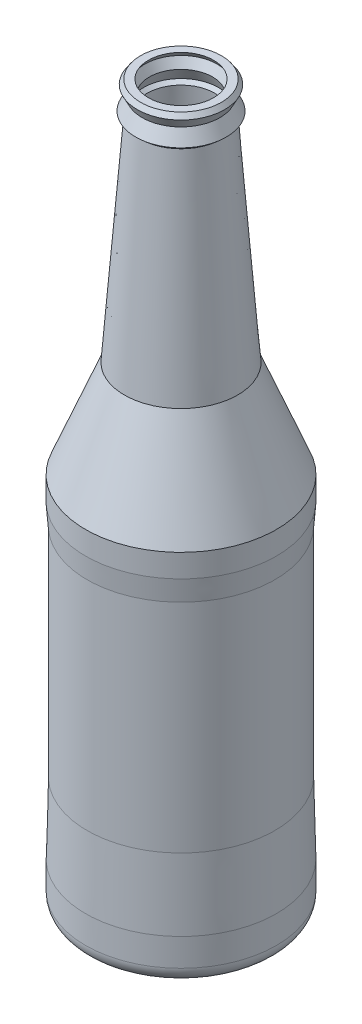
ISO-10303-21;
HEADER;
FILE_DESCRIPTION(('STEP AP214'),'2;1');
FILE_NAME('part.step','',(''),(''),'','','');
FILE_SCHEMA(('AUTOMOTIVE_DESIGN { 1 0 10303 214 1 1 1 1 }'));
ENDSEC;
DATA;
#1=APPLICATION_CONTEXT('core data for automotive mechanical design processes');
#2=APPLICATION_PROTOCOL_DEFINITION('international standard','automotive_design',2000,#1);
#3=PRODUCT_CONTEXT('',#1,'mechanical');
#4=PRODUCT('Part','Part','',(#3));
#5=PRODUCT_RELATED_PRODUCT_CATEGORY('part','',(#4));
#6=PRODUCT_DEFINITION_FORMATION('','',#4);
#7=PRODUCT_DEFINITION_CONTEXT('part definition',#1,'design');
#8=PRODUCT_DEFINITION('design','',#6,#7);
#9=PRODUCT_DEFINITION_SHAPE('','',#8);
#10=(LENGTH_UNIT() NAMED_UNIT(*) SI_UNIT(.MILLI.,.METRE.));
#11=(NAMED_UNIT(*) PLANE_ANGLE_UNIT() SI_UNIT($,.RADIAN.));
#12=(NAMED_UNIT(*) SI_UNIT($,.STERADIAN.) SOLID_ANGLE_UNIT());
#13=UNCERTAINTY_MEASURE_WITH_UNIT(LENGTH_MEASURE(1.E-05),#10,'distance_accuracy_value','');
#14=(GEOMETRIC_REPRESENTATION_CONTEXT(3) GLOBAL_UNCERTAINTY_ASSIGNED_CONTEXT((#13)) GLOBAL_UNIT_ASSIGNED_CONTEXT((#10,
#11,#12)) REPRESENTATION_CONTEXT('',''));
#15=CARTESIAN_POINT('',(0.,0.,0.));
#16=DIRECTION('',(0.,0.,1.));
#17=DIRECTION('',(1.,0.,0.));
#18=AXIS2_PLACEMENT_3D('',#15,#16,#17);
#19=CARTESIAN_POINT('',(2.68667558412261,14.6918020257161,0.));
#20=DIRECTION('',(0.,1.,0.));
#21=DIRECTION('',(0.,0.,1.));
#22=AXIS2_PLACEMENT_3D('',#19,#20,#21);
#23=PLANE('',#22);
#24=CARTESIAN_POINT('',(2.68667558412261,14.6918020257161,0.));
#25=DIRECTION('',(0.,1.,0.));
#26=DIRECTION('',(0.,0.,1.));
#27=AXIS2_PLACEMENT_3D('',#24,#25,#26);
#28=CIRCLE('',#27,10.0699667953157);
#29=CARTESIAN_POINT('',(2.68667558412261,14.6918020257161,10.0699667953157));
#30=VERTEX_POINT('',#29);
#31=EDGE_CURVE('E82',#30,#30,#28,.F.);
#32=ORIENTED_EDGE('',*,*,#31,.T.);
#33=EDGE_LOOP('',(#32));
#34=FACE_BOUND('',#33,.T.);
#35=CARTESIAN_POINT('',(2.68667558412261,14.6918020257161,0.));
#36=DIRECTION('',(0.,-1.,0.));
#37=DIRECTION('',(0.,0.,-1.));
#38=AXIS2_PLACEMENT_3D('',#35,#36,#37);
#39=CIRCLE('',#38,12.5);
#40=CARTESIAN_POINT('',(2.68667558412261,14.6918020257161,-12.5));
#41=VERTEX_POINT('',#40);
#42=EDGE_CURVE('E42',#41,#41,#39,.T.);
#43=ORIENTED_EDGE('',*,*,#42,.F.);
#44=EDGE_LOOP('',(#43));
#45=FACE_BOUND('',#44,.T.);
#46=ADVANCED_FACE('F31',(#34,#45),#23,.T.);
#47=CARTESIAN_POINT('',(2.68667558412261,13.2427782560675,0.));
#48=DIRECTION('',(0.,-1.,0.));
#49=DIRECTION('',(0.,0.,-1.));
#50=AXIS2_PLACEMENT_3D('',#47,#48,#49);
#51=CONICAL_SURFACE('',#50,13.5,0.604064136276855);
#52=ORIENTED_EDGE('',*,*,#42,.T.);
#53=EDGE_LOOP('',(#52));
#54=FACE_BOUND('',#53,.T.);
#55=CARTESIAN_POINT('',(2.68667558412261,13.2427782560675,0.));
#56=DIRECTION('',(0.,-1.,0.));
#57=DIRECTION('',(0.,0.,-1.));
#58=AXIS2_PLACEMENT_3D('',#55,#56,#57);
#59=CIRCLE('',#58,13.5);
#60=CARTESIAN_POINT('',(2.68667558412261,13.2427782560675,-13.5));
#61=VERTEX_POINT('',#60);
#62=EDGE_CURVE('E46',#61,#61,#59,.T.);
#63=ORIENTED_EDGE('',*,*,#62,.F.);
#64=EDGE_LOOP('',(#63));
#65=FACE_BOUND('',#64,.T.);
#66=ADVANCED_FACE('F193',(#54,#65),#51,.T.);
#67=CARTESIAN_POINT('',(2.68667558412261,10.3278059171745,0.));
#68=DIRECTION('',(0.,1.,0.));
#69=DIRECTION('',(0.,0.,1.));
#70=AXIS2_PLACEMENT_3D('',#67,#68,#69);
#71=CONICAL_SURFACE('',#70,12.,0.475247130054675);
#72=ORIENTED_EDGE('',*,*,#62,.T.);
#73=EDGE_LOOP('',(#72));
#74=FACE_BOUND('',#73,.T.);
#75=CARTESIAN_POINT('',(2.68667558412261,10.3278059171745,0.));
#76=DIRECTION('',(0.,-1.,0.));
#77=DIRECTION('',(0.,0.,-1.));
#78=AXIS2_PLACEMENT_3D('',#75,#76,#77);
#79=CIRCLE('',#78,12.);
#80=CARTESIAN_POINT('',(2.68667558412261,10.3278059171745,-12.));
#81=VERTEX_POINT('',#80);
#82=EDGE_CURVE('E51',#81,#81,#79,.T.);
#83=ORIENTED_EDGE('',*,*,#82,.F.);
#84=EDGE_LOOP('',(#83));
#85=FACE_BOUND('',#84,.T.);
#86=ADVANCED_FACE('F198',(#74,#85),#71,.T.);
#87=CARTESIAN_POINT('',(2.68667558412261,6.1418129077232,0.));
#88=DIRECTION('',(0.,-1.,0.));
#89=DIRECTION('',(0.,0.,-1.));
#90=AXIS2_PLACEMENT_3D('',#87,#88,#89);
#91=CONICAL_SURFACE('',#90,14.,0.445717284311915);
#92=ORIENTED_EDGE('',*,*,#82,.T.);
#93=EDGE_LOOP('',(#92));
#94=FACE_BOUND('',#93,.T.);
#95=CARTESIAN_POINT('',(2.68667558412261,6.1418129077232,0.));
#96=DIRECTION('',(0.,-1.,0.));
#97=DIRECTION('',(0.,0.,-1.));
#98=AXIS2_PLACEMENT_3D('',#95,#96,#97);
#99=CIRCLE('',#98,14.);
#100=CARTESIAN_POINT('',(2.68667558412261,6.1418129077232,-14.));
#101=VERTEX_POINT('',#100);
#102=EDGE_CURVE('E54',#101,#101,#99,.T.);
#103=ORIENTED_EDGE('',*,*,#102,.F.);
#104=EDGE_LOOP('',(#103));
#105=FACE_BOUND('',#104,.T.);
#106=ADVANCED_FACE('F205',(#94,#105),#91,.T.);
#107=CARTESIAN_POINT('',(2.68667558412261,4.83649685341092,0.));
#108=DIRECTION('',(0.,1.,0.));
#109=DIRECTION('',(0.,0.,1.));
#110=AXIS2_PLACEMENT_3D('',#107,#108,#109);
#111=CONICAL_SURFACE('',#110,12.5,0.854685296110276);
#112=ORIENTED_EDGE('',*,*,#102,.T.);
#113=EDGE_LOOP('',(#112));
#114=FACE_BOUND('',#113,.T.);
#115=CARTESIAN_POINT('',(2.68667558412261,4.83649685341092,0.));
#116=DIRECTION('',(0.,-1.,0.));
#117=DIRECTION('',(0.,0.,-1.));
#118=AXIS2_PLACEMENT_3D('',#115,#116,#117);
#119=CIRCLE('',#118,12.5);
#120=CARTESIAN_POINT('',(2.68667558412261,4.83649685341092,-12.5));
#121=VERTEX_POINT('',#120);
#122=EDGE_CURVE('E57',#121,#121,#119,.T.);
#123=ORIENTED_EDGE('',*,*,#122,.F.);
#124=EDGE_LOOP('',(#123));
#125=FACE_BOUND('',#124,.T.);
#126=ADVANCED_FACE('F209',(#114,#125),#111,.T.);
#127=CARTESIAN_POINT('',(2.68667558412261,-61.1635031465891,0.));
#128=DIRECTION('',(0.,-1.,0.));
#129=DIRECTION('',(0.,0.,-1.));
#130=AXIS2_PLACEMENT_3D('',#127,#128,#129);
#131=CONICAL_SURFACE('',#130,17.5,0.0756131432368299);
#132=ORIENTED_EDGE('',*,*,#122,.T.);
#133=EDGE_LOOP('',(#132));
#134=FACE_BOUND('',#133,.T.);
#135=CARTESIAN_POINT('',(2.68667558412261,-61.1635031465891,0.));
#136=DIRECTION('',(0.,-1.,0.));
#137=DIRECTION('',(0.,0.,-1.));
#138=AXIS2_PLACEMENT_3D('',#135,#136,#137);
#139=CIRCLE('',#138,17.5);
#140=CARTESIAN_POINT('',(2.68667558412261,-61.1635031465891,-17.5));
#141=VERTEX_POINT('',#140);
#142=EDGE_CURVE('E60',#141,#141,#139,.T.);
#143=ORIENTED_EDGE('',*,*,#142,.F.);
#144=EDGE_LOOP('',(#143));
#145=FACE_BOUND('',#144,.T.);
#146=ADVANCED_FACE('F213',(#134,#145),#131,.T.);
#147=CARTESIAN_POINT('',(2.68667558412261,-91.1635031465891,0.));
#148=DIRECTION('',(0.,-1.,0.));
#149=DIRECTION('',(0.,0.,-1.));
#150=AXIS2_PLACEMENT_3D('',#147,#148,#149);
#151=CONICAL_SURFACE('',#150,29.5,0.380506377112365);
#152=ORIENTED_EDGE('',*,*,#142,.T.);
#153=EDGE_LOOP('',(#152));
#154=FACE_BOUND('',#153,.T.);
#155=CARTESIAN_POINT('',(2.68667558412261,-91.1635031465891,0.));
#156=DIRECTION('',(0.,-1.,0.));
#157=DIRECTION('',(0.,0.,-1.));
#158=AXIS2_PLACEMENT_3D('',#155,#156,#157);
#159=CIRCLE('',#158,29.5);
#160=CARTESIAN_POINT('',(2.68667558412261,-91.1635031465891,-29.5));
#161=VERTEX_POINT('',#160);
#162=EDGE_CURVE('E63',#161,#161,#159,.T.);
#163=ORIENTED_EDGE('',*,*,#162,.F.);
#164=EDGE_LOOP('',(#163));
#165=FACE_BOUND('',#164,.T.);
#166=ADVANCED_FACE('F217',(#154,#165),#151,.T.);
#167=CARTESIAN_POINT('',(2.68667558412261,-210.308197974284,0.));
#168=DIRECTION('',(0.,-1.,0.));
#169=DIRECTION('',(0.,0.,-1.));
#170=AXIS2_PLACEMENT_3D('',#167,#168,#169);
#171=CYLINDRICAL_SURFACE('',#170,29.5);
#172=ORIENTED_EDGE('',*,*,#162,.T.);
#173=EDGE_LOOP('',(#172));
#174=FACE_BOUND('',#173,.T.);
#175=CARTESIAN_POINT('',(2.68667558412261,-98.2679449174877,0.));
#176=DIRECTION('',(0.,-1.,0.));
#177=DIRECTION('',(0.,0.,-1.));
#178=AXIS2_PLACEMENT_3D('',#175,#176,#177);
#179=CIRCLE('',#178,29.5);
#180=CARTESIAN_POINT('',(2.68667558412261,-98.2679449174877,-29.5));
#181=VERTEX_POINT('',#180);
#182=EDGE_CURVE('E66',#181,#181,#179,.T.);
#183=ORIENTED_EDGE('',*,*,#182,.F.);
#184=EDGE_LOOP('',(#183));
#185=FACE_BOUND('',#184,.T.);
#186=ADVANCED_FACE('F221',(#174,#185),#171,.T.);
#187=CARTESIAN_POINT('',(2.68667558412261,-104.864926561894,0.));
#188=DIRECTION('',(0.,1.,0.));
#189=DIRECTION('',(0.,0.,1.));
#190=AXIS2_PLACEMENT_3D('',#187,#188,#189);
#191=CONICAL_SURFACE('',#190,29.,0.0756476071573336);
#192=ORIENTED_EDGE('',*,*,#182,.T.);
#193=EDGE_LOOP('',(#192));
#194=FACE_BOUND('',#193,.T.);
#195=CARTESIAN_POINT('',(2.68667558412261,-104.864926561894,0.));
#196=DIRECTION('',(0.,-1.,0.));
#197=DIRECTION('',(0.,0.,-1.));
#198=AXIS2_PLACEMENT_3D('',#195,#196,#197);
#199=CIRCLE('',#198,29.);
#200=CARTESIAN_POINT('',(2.68667558412261,-104.864926561894,-29.));
#201=VERTEX_POINT('',#200);
#202=EDGE_CURVE('E69',#201,#201,#199,.T.);
#203=ORIENTED_EDGE('',*,*,#202,.F.);
#204=EDGE_LOOP('',(#203));
#205=FACE_BOUND('',#204,.T.);
#206=ADVANCED_FACE('F225',(#194,#205),#191,.T.);
#207=CARTESIAN_POINT('',(2.68667558412261,-210.308197974284,0.));
#208=DIRECTION('',(0.,-1.,0.));
#209=DIRECTION('',(0.,0.,-1.));
#210=AXIS2_PLACEMENT_3D('',#207,#208,#209);
#211=CYLINDRICAL_SURFACE('',#210,29.);
#212=ORIENTED_EDGE('',*,*,#202,.T.);
#213=EDGE_LOOP('',(#212));
#214=FACE_BOUND('',#213,.T.);
#215=CARTESIAN_POINT('',(2.68667558412261,-171.996704513404,0.));
#216=DIRECTION('',(0.,-1.,0.));
#217=DIRECTION('',(0.,0.,-1.));
#218=AXIS2_PLACEMENT_3D('',#215,#216,#217);
#219=CIRCLE('',#218,29.);
#220=CARTESIAN_POINT('',(2.68667558412261,-171.996704513404,-29.));
#221=VERTEX_POINT('',#220);
#222=EDGE_CURVE('E72',#221,#221,#219,.T.);
#223=ORIENTED_EDGE('',*,*,#222,.F.);
#224=EDGE_LOOP('',(#223));
#225=FACE_BOUND('',#224,.T.);
#226=ADVANCED_FACE('F229',(#214,#225),#211,.T.);
#227=CARTESIAN_POINT('',(2.68667558412261,-193.979014242991,0.));
#228=DIRECTION('',(0.,-1.,0.));
#229=DIRECTION('',(0.,0.,-1.));
#230=AXIS2_PLACEMENT_3D('',#227,#228,#229);
#231=CONICAL_SURFACE('',#230,29.5,0.022741641171332);
#232=ORIENTED_EDGE('',*,*,#222,.T.);
#233=EDGE_LOOP('',(#232));
#234=FACE_BOUND('',#233,.T.);
#235=CARTESIAN_POINT('',(2.68667558412261,-193.979014242991,0.));
#236=DIRECTION('',(0.,-1.,0.));
#237=DIRECTION('',(0.,0.,-1.));
#238=AXIS2_PLACEMENT_3D('',#235,#236,#237);
#239=CIRCLE('',#238,29.5);
#240=CARTESIAN_POINT('',(2.68667558412261,-193.979014242991,-29.5));
#241=VERTEX_POINT('',#240);
#242=EDGE_CURVE('E75',#241,#241,#239,.T.);
#243=ORIENTED_EDGE('',*,*,#242,.F.);
#244=EDGE_LOOP('',(#243));
#245=FACE_BOUND('',#244,.T.);
#246=ADVANCED_FACE('F233',(#234,#245),#231,.T.);
#247=CARTESIAN_POINT('',(2.68667558412261,-210.308197974284,0.));
#248=DIRECTION('',(0.,-1.,0.));
#249=DIRECTION('',(0.,0.,-1.));
#250=AXIS2_PLACEMENT_3D('',#247,#248,#249);
#251=CYLINDRICAL_SURFACE('',#250,29.5);
#252=CARTESIAN_POINT('',(2.68667558412261,-202.495760268281,0.));
#253=DIRECTION('',(0.,1.,0.));
#254=DIRECTION('',(0.,0.,1.));
#255=AXIS2_PLACEMENT_3D('',#252,#253,#254);
#256=CIRCLE('',#255,29.5);
#257=CARTESIAN_POINT('',(2.68667558412261,-202.495760268281,29.5));
#258=VERTEX_POINT('',#257);
#259=EDGE_CURVE('E10',#258,#258,#256,.T.);
#260=ORIENTED_EDGE('',*,*,#259,.T.);
#261=EDGE_LOOP('',(#260));
#262=FACE_BOUND('',#261,.T.);
#263=ORIENTED_EDGE('',*,*,#242,.T.);
#264=EDGE_LOOP('',(#263));
#265=FACE_BOUND('',#264,.T.);
#266=ADVANCED_FACE('F237',(#262,#265),#251,.T.);
#267=CARTESIAN_POINT('',(2.68667558412261,-210.308197974284,0.));
#268=DIRECTION('',(0.,1.,0.));
#269=DIRECTION('',(0.,0.,1.));
#270=AXIS2_PLACEMENT_3D('',#267,#268,#269);
#271=CONICAL_SURFACE('',#270,21.9570338737568,0.968951808889108);
#272=CARTESIAN_POINT('',(2.68667558412261,-206.617223860034,0.));
#273=DIRECTION('',(0.,-1.,0.));
#274=DIRECTION('',(0.,0.,-1.));
#275=AXIS2_PLACEMENT_3D('',#272,#273,#274);
#276=CIRCLE('',#275,27.3308192916284);
#277=CARTESIAN_POINT('',(2.68667558412261,-206.617223860034,-27.3308192916284));
#278=VERTEX_POINT('',#277);
#279=EDGE_CURVE('E38',#278,#278,#276,.T.);
#280=ORIENTED_EDGE('',*,*,#279,.T.);
#281=EDGE_LOOP('',(#280));
#282=FACE_BOUND('',#281,.T.);
#283=CARTESIAN_POINT('',(2.68667558412261,-210.308197974284,0.));
#284=DIRECTION('',(0.,-1.,0.));
#285=DIRECTION('',(0.,0.,-1.));
#286=AXIS2_PLACEMENT_3D('',#283,#284,#285);
#287=CIRCLE('',#286,21.9570338737568);
#288=CARTESIAN_POINT('',(2.68667558412261,-210.308197974284,-21.9570338737568));
#289=VERTEX_POINT('',#288);
#290=EDGE_CURVE('E78',#289,#289,#287,.T.);
#291=ORIENTED_EDGE('',*,*,#290,.F.);
#292=EDGE_LOOP('',(#291));
#293=FACE_BOUND('',#292,.T.);
#294=ADVANCED_FACE('F241',(#282,#293),#271,.T.);
#295=CARTESIAN_POINT('',(24.6437094578794,-210.308197974284,0.));
#296=DIRECTION('',(0.,-1.,0.));
#297=DIRECTION('',(0.,0.,-1.));
#298=AXIS2_PLACEMENT_3D('',#295,#296,#297);
#299=PLANE('',#298);
#300=ORIENTED_EDGE('',*,*,#290,.T.);
#301=EDGE_LOOP('',(#300));
#302=FACE_BOUND('',#301,.T.);
#303=ADVANCED_FACE('F244',(#302),#299,.T.);
#304=CARTESIAN_POINT('',(2.68667558412261,-202.495760268281,0.));
#305=DIRECTION('',(0.,1.,0.));
#306=DIRECTION('',(0.,0.,1.));
#307=AXIS2_PLACEMENT_3D('',#304,#305,#306);
#308=TOROIDAL_SURFACE('',#307,24.5,5.);
#309=ORIENTED_EDGE('',*,*,#259,.F.);
#310=EDGE_LOOP('',(#309));
#311=FACE_BOUND('',#310,.T.);
#312=ORIENTED_EDGE('',*,*,#279,.F.);
#313=EDGE_LOOP('',(#312));
#314=FACE_BOUND('',#313,.T.);
#315=ADVANCED_FACE('F33',(#311,#314),#308,.T.);
#316=CARTESIAN_POINT('',(2.68667558412261,12.1067941012208,0.));
#317=DIRECTION('',(0.,-1.,0.));
#318=DIRECTION('',(0.,0.,-1.));
#319=AXIS2_PLACEMENT_3D('',#316,#317,#318);
#320=CONICAL_SURFACE('',#319,11.853931957683,0.604064136276855);
#321=ORIENTED_EDGE('',*,*,#31,.F.);
#322=EDGE_LOOP('',(#321));
#323=FACE_BOUND('',#322,.T.);
#324=CARTESIAN_POINT('',(2.68667558412261,13.0927256766299,0.));
#325=DIRECTION('',(0.,-1.,0.));
#326=DIRECTION('',(0.,0.,-1.));
#327=AXIS2_PLACEMENT_3D('',#324,#325,#326);
#328=CIRCLE('',#327,11.1735210520371);
#329=CARTESIAN_POINT('',(2.68667558412261,13.0927256766299,-11.1735210520371));
#330=VERTEX_POINT('',#329);
#331=EDGE_CURVE('E86',#330,#330,#328,.T.);
#332=ORIENTED_EDGE('',*,*,#331,.T.);
#333=EDGE_LOOP('',(#332));
#334=FACE_BOUND('',#333,.T.);
#335=ADVANCED_FACE('F124',(#323,#334),#320,.F.);
#336=CARTESIAN_POINT('',(2.68667558412261,11.2429223255146,0.));
#337=DIRECTION('',(0.,1.,0.));
#338=DIRECTION('',(0.,0.,1.));
#339=AXIS2_PLACEMENT_3D('',#336,#337,#338);
#340=CONICAL_SURFACE('',#339,10.2216406552143,0.475247130054675);
#341=ORIENTED_EDGE('',*,*,#331,.F.);
#342=EDGE_LOOP('',(#341));
#343=FACE_BOUND('',#342,.T.);
#344=CARTESIAN_POINT('',(2.68667558412261,10.3607680848068,0.));
#345=DIRECTION('',(0.,-1.,0.));
#346=DIRECTION('',(0.,0.,-1.));
#347=AXIS2_PLACEMENT_3D('',#344,#345,#346);
#348=CIRCLE('',#347,9.7676976302989);
#349=CARTESIAN_POINT('',(2.68667558412261,10.3607680848068,-9.7676976302989));
#350=VERTEX_POINT('',#349);
#351=EDGE_CURVE('E118',#350,#350,#348,.T.);
#352=ORIENTED_EDGE('',*,*,#351,.T.);
#353=EDGE_LOOP('',(#352));
#354=FACE_BOUND('',#353,.T.);
#355=ADVANCED_FACE('F126',(#343,#354),#340,.F.);
#356=CARTESIAN_POINT('',(2.68667558412261,5.27960251176149,0.));
#357=DIRECTION('',(0.,-1.,0.));
#358=DIRECTION('',(0.,0.,-1.));
#359=AXIS2_PLACEMENT_3D('',#356,#357,#358);
#360=CONICAL_SURFACE('',#359,12.195396654914,0.445717284311915);
#361=ORIENTED_EDGE('',*,*,#351,.F.);
#362=EDGE_LOOP('',(#361));
#363=FACE_BOUND('',#362,.T.);
#364=CARTESIAN_POINT('',(2.68667558412261,6.65204317559221,0.));
#365=DIRECTION('',(0.,-1.,0.));
#366=DIRECTION('',(0.,0.,-1.));
#367=AXIS2_PLACEMENT_3D('',#364,#365,#366);
#368=CIRCLE('',#367,11.5396666234821);
#369=CARTESIAN_POINT('',(2.68667558412261,6.65204317559221,-11.5396666234821));
#370=VERTEX_POINT('',#369);
#371=EDGE_CURVE('E115',#370,#370,#368,.T.);
#372=ORIENTED_EDGE('',*,*,#371,.T.);
#373=EDGE_LOOP('',(#372));
#374=FACE_BOUND('',#373,.T.);
#375=ADVANCED_FACE('F129',(#363,#374),#360,.F.);
#376=CARTESIAN_POINT('',(2.68667558412261,6.34522558192026,0.));
#377=DIRECTION('',(0.,1.,0.));
#378=DIRECTION('',(0.,0.,1.));
#379=AXIS2_PLACEMENT_3D('',#376,#377,#378);
#380=CONICAL_SURFACE('',#379,11.1870881127164,0.854685296110276);
#381=ORIENTED_EDGE('',*,*,#371,.F.);
#382=EDGE_LOOP('',(#381));
#383=FACE_BOUND('',#382,.T.);
#384=CARTESIAN_POINT('',(2.68667558412261,5.68630343165584,0.));
#385=DIRECTION('',(0.,-1.,0.));
#386=DIRECTION('',(0.,0.,-1.));
#387=AXIS2_PLACEMENT_3D('',#384,#385,#386);
#388=CIRCLE('',#387,10.4298897145726);
#389=CARTESIAN_POINT('',(2.68667558412261,5.68630343165584,-10.4298897145726));
#390=VERTEX_POINT('',#389);
#391=EDGE_CURVE('E112',#390,#390,#388,.T.);
#392=ORIENTED_EDGE('',*,*,#391,.T.);
#393=EDGE_LOOP('',(#392));
#394=FACE_BOUND('',#393,.T.);
#395=ADVANCED_FACE('F135',(#383,#394),#380,.F.);
#396=CARTESIAN_POINT('',(2.68667558412261,-61.3145853720479,0.));
#397=DIRECTION('',(0.,-1.,0.));
#398=DIRECTION('',(0.,0.,-1.));
#399=AXIS2_PLACEMENT_3D('',#396,#397,#398);
#400=CONICAL_SURFACE('',#399,15.5057146239441,0.0756131432368299);
#401=ORIENTED_EDGE('',*,*,#391,.F.);
#402=EDGE_LOOP('',(#401));
#403=FACE_BOUND('',#402,.T.);
#404=CARTESIAN_POINT('',(2.68667558412261,-61.6209846868399,0.));
#405=DIRECTION('',(0.,-1.,0.));
#406=DIRECTION('',(0.,0.,-1.));
#407=AXIS2_PLACEMENT_3D('',#404,#405,#406);
#408=CIRCLE('',#407,15.5289266932465);
#409=CARTESIAN_POINT('',(2.68667558412261,-61.6209846868399,-15.5289266932465));
#410=VERTEX_POINT('',#409);
#411=EDGE_CURVE('E109',#410,#410,#408,.T.);
#412=ORIENTED_EDGE('',*,*,#411,.T.);
#413=EDGE_LOOP('',(#412));
#414=FACE_BOUND('',#413,.T.);
#415=ADVANCED_FACE('F141',(#403,#414),#400,.F.);
#416=CARTESIAN_POINT('',(2.68667558412261,-91.9062844992973,0.));
#417=DIRECTION('',(0.,-1.,0.));
#418=DIRECTION('',(0.,0.,-1.));
#419=AXIS2_PLACEMENT_3D('',#416,#417,#418);
#420=CONICAL_SURFACE('',#419,27.6430466182295,0.380506377112365);
#421=ORIENTED_EDGE('',*,*,#411,.F.);
#422=EDGE_LOOP('',(#421));
#423=FACE_BOUND('',#422,.T.);
#424=CARTESIAN_POINT('',(2.68667558412261,-91.5486679537236,0.));
#425=DIRECTION('',(0.,-1.,0.));
#426=DIRECTION('',(0.,0.,-1.));
#427=AXIS2_PLACEMENT_3D('',#424,#425,#426);
#428=CIRCLE('',#427,27.5);
#429=CARTESIAN_POINT('',(2.68667558412261,-91.5486679537236,-27.5));
#430=VERTEX_POINT('',#429);
#431=EDGE_CURVE('E106',#430,#430,#428,.T.);
#432=ORIENTED_EDGE('',*,*,#431,.T.);
#433=EDGE_LOOP('',(#432));
#434=FACE_BOUND('',#433,.T.);
#435=ADVANCED_FACE('F147',(#423,#434),#420,.F.);
#436=CARTESIAN_POINT('',(2.68667558412261,-210.308197974284,0.));
#437=DIRECTION('',(0.,-1.,0.));
#438=DIRECTION('',(0.,0.,-1.));
#439=AXIS2_PLACEMENT_3D('',#436,#437,#438);
#440=CYLINDRICAL_SURFACE('',#439,27.5);
#441=ORIENTED_EDGE('',*,*,#431,.F.);
#442=EDGE_LOOP('',(#441));
#443=FACE_BOUND('',#442,.T.);
#444=CARTESIAN_POINT('',(2.68667558412261,-98.1922612148406,0.));
#445=DIRECTION('',(0.,1.,0.));
#446=DIRECTION('',(0.,0.,1.));
#447=AXIS2_PLACEMENT_3D('',#444,#445,#446);
#448=CIRCLE('',#447,27.5);
#449=CARTESIAN_POINT('',(2.68667558412261,-98.1922612148406,27.5));
#450=VERTEX_POINT('',#449);
#451=EDGE_CURVE('E103',#450,#450,#448,.F.);
#452=ORIENTED_EDGE('',*,*,#451,.T.);
#453=EDGE_LOOP('',(#452));
#454=FACE_BOUND('',#453,.T.);
#455=ADVANCED_FACE('F153',(#443,#454),#440,.F.);
#456=CARTESIAN_POINT('',(2.68667558412261,-104.713775605632,0.));
#457=DIRECTION('',(0.,1.,0.));
#458=DIRECTION('',(0.,0.,1.));
#459=AXIS2_PLACEMENT_3D('',#456,#457,#458);
#460=CONICAL_SURFACE('',#459,27.0057198320143,0.0756476071573336);
#461=ORIENTED_EDGE('',*,*,#451,.F.);
#462=EDGE_LOOP('',(#461));
#463=FACE_BOUND('',#462,.T.);
#464=CARTESIAN_POINT('',(2.68667558412261,-104.789242859246,0.));
#465=DIRECTION('',(0.,1.,0.));
#466=DIRECTION('',(0.,0.,1.));
#467=AXIS2_PLACEMENT_3D('',#464,#465,#466);
#468=CIRCLE('',#467,27.);
#469=CARTESIAN_POINT('',(2.68667558412261,-104.789242859246,27.));
#470=VERTEX_POINT('',#469);
#471=EDGE_CURVE('E100',#470,#470,#468,.F.);
#472=ORIENTED_EDGE('',*,*,#471,.T.);
#473=EDGE_LOOP('',(#472));
#474=FACE_BOUND('',#473,.T.);
#475=ADVANCED_FACE('F159',(#463,#474),#460,.F.);
#476=CARTESIAN_POINT('',(2.68667558412261,-210.308197974284,0.));
#477=DIRECTION('',(0.,-1.,0.));
#478=DIRECTION('',(0.,0.,-1.));
#479=AXIS2_PLACEMENT_3D('',#476,#477,#478);
#480=CYLINDRICAL_SURFACE('',#479,27.);
#481=ORIENTED_EDGE('',*,*,#471,.F.);
#482=EDGE_LOOP('',(#481));
#483=FACE_BOUND('',#482,.T.);
#484=CARTESIAN_POINT('',(2.68667558412261,-172.019447134757,0.));
#485=DIRECTION('',(0.,-1.,0.));
#486=DIRECTION('',(0.,0.,-1.));
#487=AXIS2_PLACEMENT_3D('',#484,#485,#486);
#488=CIRCLE('',#487,27.);
#489=CARTESIAN_POINT('',(2.68667558412261,-172.019447134757,-27.));
#490=VERTEX_POINT('',#489);
#491=EDGE_CURVE('E97',#490,#490,#488,.T.);
#492=ORIENTED_EDGE('',*,*,#491,.T.);
#493=EDGE_LOOP('',(#492));
#494=FACE_BOUND('',#493,.T.);
#495=ADVANCED_FACE('F165',(#483,#494),#480,.F.);
#496=CARTESIAN_POINT('',(2.68667558412261,-194.024493604911,0.));
#497=DIRECTION('',(0.,-1.,0.));
#498=DIRECTION('',(0.,0.,-1.));
#499=AXIS2_PLACEMENT_3D('',#496,#497,#498);
#500=CONICAL_SURFACE('',#499,27.5005171599538,0.022741641171332);
#501=ORIENTED_EDGE('',*,*,#491,.F.);
#502=EDGE_LOOP('',(#501));
#503=FACE_BOUND('',#502,.T.);
#504=CARTESIAN_POINT('',(2.68667558412261,-194.001756864344,0.));
#505=DIRECTION('',(0.,-1.,0.));
#506=DIRECTION('',(0.,0.,-1.));
#507=AXIS2_PLACEMENT_3D('',#504,#505,#506);
#508=CIRCLE('',#507,27.5);
#509=CARTESIAN_POINT('',(2.68667558412261,-194.001756864344,-27.5));
#510=VERTEX_POINT('',#509);
#511=EDGE_CURVE('E90',#510,#510,#508,.T.);
#512=ORIENTED_EDGE('',*,*,#511,.T.);
#513=EDGE_LOOP('',(#512));
#514=FACE_BOUND('',#513,.T.);
#515=ADVANCED_FACE('F171',(#503,#514),#500,.F.);
#516=CARTESIAN_POINT('',(2.68667558412261,-210.308197974284,0.));
#517=DIRECTION('',(0.,-1.,0.));
#518=DIRECTION('',(0.,0.,-1.));
#519=AXIS2_PLACEMENT_3D('',#516,#517,#518);
#520=CYLINDRICAL_SURFACE('',#519,27.5);
#521=CARTESIAN_POINT('',(2.68667558412261,-202.495760268281,0.));
#522=DIRECTION('',(0.,-1.,0.));
#523=DIRECTION('',(0.,0.,-1.));
#524=AXIS2_PLACEMENT_3D('',#521,#522,#523);
#525=CIRCLE('',#524,27.5);
#526=CARTESIAN_POINT('',(2.68667558412261,-202.495760268281,-27.5));
#527=VERTEX_POINT('',#526);
#528=EDGE_CURVE('E81',#527,#527,#525,.F.);
#529=ORIENTED_EDGE('',*,*,#528,.F.);
#530=EDGE_LOOP('',(#529));
#531=FACE_BOUND('',#530,.T.);
#532=ORIENTED_EDGE('',*,*,#511,.F.);
#533=EDGE_LOOP('',(#532));
#534=FACE_BOUND('',#533,.T.);
#535=ADVANCED_FACE('F177',(#531,#534),#520,.F.);
#536=CARTESIAN_POINT('',(2.68667558412261,-208.659612537583,0.));
#537=DIRECTION('',(0.,1.,0.));
#538=DIRECTION('',(0.,0.,1.));
#539=AXIS2_PLACEMENT_3D('',#536,#537,#538);
#540=CONICAL_SURFACE('',#539,20.8247061571054,0.968951808889108);
#541=CARTESIAN_POINT('',(2.68667558412261,-204.968638423333,0.));
#542=DIRECTION('',(0.,1.,0.));
#543=DIRECTION('',(0.,0.,1.));
#544=AXIS2_PLACEMENT_3D('',#541,#542,#543);
#545=CIRCLE('',#544,26.198491574977);
#546=CARTESIAN_POINT('',(2.68667558412261,-204.968638423333,26.198491574977));
#547=VERTEX_POINT('',#546);
#548=EDGE_CURVE('E85',#547,#547,#545,.F.);
#549=ORIENTED_EDGE('',*,*,#548,.F.);
#550=EDGE_LOOP('',(#549));
#551=FACE_BOUND('',#550,.T.);
#552=CARTESIAN_POINT('',(2.68667558412261,-208.308197974284,0.));
#553=DIRECTION('',(0.,-1.,0.));
#554=DIRECTION('',(0.,0.,-1.));
#555=AXIS2_PLACEMENT_3D('',#552,#553,#554);
#556=CIRCLE('',#555,21.3363397794038);
#557=CARTESIAN_POINT('',(2.68667558412261,-208.308197974284,-21.3363397794038));
#558=VERTEX_POINT('',#557);
#559=EDGE_CURVE('E87',#558,#558,#556,.T.);
#560=ORIENTED_EDGE('',*,*,#559,.T.);
#561=EDGE_LOOP('',(#560));
#562=FACE_BOUND('',#561,.T.);
#563=ADVANCED_FACE('F182',(#551,#562),#540,.F.);
#564=CARTESIAN_POINT('',(24.6437094578794,-208.308197974284,0.));
#565=DIRECTION('',(0.,-1.,0.));
#566=DIRECTION('',(0.,0.,-1.));
#567=AXIS2_PLACEMENT_3D('',#564,#565,#566);
#568=PLANE('',#567);
#569=ORIENTED_EDGE('',*,*,#559,.F.);
#570=EDGE_LOOP('',(#569));
#571=FACE_BOUND('',#570,.T.);
#572=ADVANCED_FACE('F188',(#571),#568,.F.);
#573=CARTESIAN_POINT('',(2.68667558412261,-202.495760268281,0.));
#574=DIRECTION('',(0.,1.,0.));
#575=DIRECTION('',(0.,0.,1.));
#576=AXIS2_PLACEMENT_3D('',#573,#574,#575);
#577=TOROIDAL_SURFACE('',#576,24.5,3.);
#578=ORIENTED_EDGE('',*,*,#528,.T.);
#579=EDGE_LOOP('',(#578));
#580=FACE_BOUND('',#579,.T.);
#581=ORIENTED_EDGE('',*,*,#548,.T.);
#582=EDGE_LOOP('',(#581));
#583=FACE_BOUND('',#582,.T.);
#584=ADVANCED_FACE('F248',(#580,#583),#577,.F.);
#585=CLOSED_SHELL('',(#46,#66,#86,#106,#126,#146,#166,#186,#206,#226,#246,#266,#294,#303,#315,
#335,#355,#375,#395,#415,#435,#455,#475,#495,#515,#535,#563,#572,#584));
#586=MANIFOLD_SOLID_BREP('B2',#585);
#587=ADVANCED_BREP_SHAPE_REPRESENTATION('',(#18,#586),#14);
#588=SHAPE_DEFINITION_REPRESENTATION(#9,#587);
ENDSEC;
END-ISO-10303-21;
